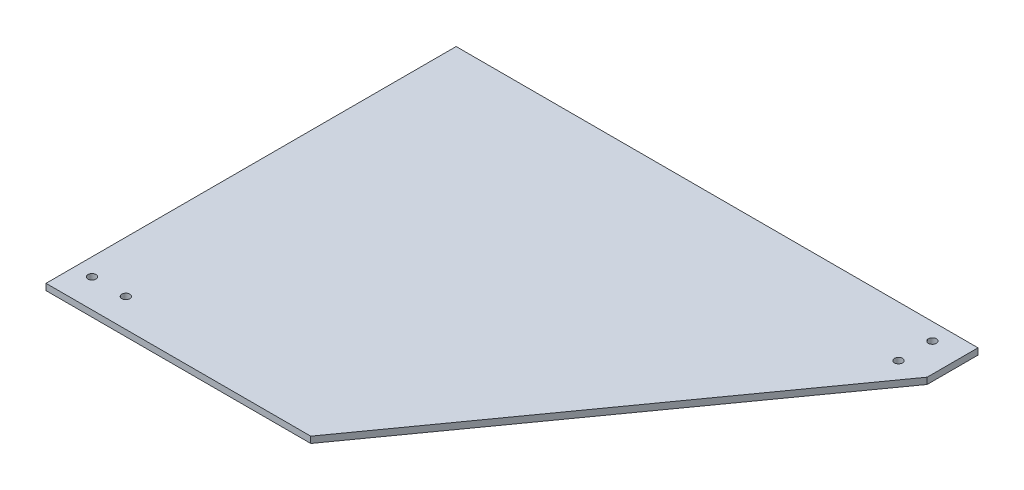
ISO-10303-21;
HEADER;
FILE_DESCRIPTION(('STEP AP214'),'2;1');
FILE_NAME('part.step','',(''),(''),'','','');
FILE_SCHEMA(('AUTOMOTIVE_DESIGN { 1 0 10303 214 1 1 1 1 }'));
ENDSEC;
DATA;
#1=APPLICATION_CONTEXT('core data for automotive mechanical design processes');
#2=APPLICATION_PROTOCOL_DEFINITION('international standard','automotive_design',2000,#1);
#3=PRODUCT_CONTEXT('',#1,'mechanical');
#4=PRODUCT('Part','Part','',(#3));
#5=PRODUCT_RELATED_PRODUCT_CATEGORY('part','',(#4));
#6=PRODUCT_DEFINITION_FORMATION('','',#4);
#7=PRODUCT_DEFINITION_CONTEXT('part definition',#1,'design');
#8=PRODUCT_DEFINITION('design','',#6,#7);
#9=PRODUCT_DEFINITION_SHAPE('','',#8);
#10=(LENGTH_UNIT() NAMED_UNIT(*) SI_UNIT(.MILLI.,.METRE.));
#11=(NAMED_UNIT(*) PLANE_ANGLE_UNIT() SI_UNIT($,.RADIAN.));
#12=(NAMED_UNIT(*) SI_UNIT($,.STERADIAN.) SOLID_ANGLE_UNIT());
#13=UNCERTAINTY_MEASURE_WITH_UNIT(LENGTH_MEASURE(1.E-05),#10,'distance_accuracy_value','');
#14=(GEOMETRIC_REPRESENTATION_CONTEXT(3) GLOBAL_UNCERTAINTY_ASSIGNED_CONTEXT((#13)) GLOBAL_UNIT_ASSIGNED_CONTEXT((#10,
#11,#12)) REPRESENTATION_CONTEXT('',''));
#15=CARTESIAN_POINT('',(0.,0.,0.));
#16=DIRECTION('',(0.,0.,1.));
#17=DIRECTION('',(1.,0.,0.));
#18=AXIS2_PLACEMENT_3D('',#15,#16,#17);
#19=CARTESIAN_POINT('',(0.,3.,0.));
#20=DIRECTION('',(0.,1.,0.));
#21=DIRECTION('',(0.,0.,1.));
#22=AXIS2_PLACEMENT_3D('',#19,#20,#21);
#23=PLANE('',#22);
#24=CARTESIAN_POINT('',(-115.,3.,180.152));
#25=DIRECTION('',(0.,1.,0.));
#26=DIRECTION('',(0.,0.,1.));
#27=AXIS2_PLACEMENT_3D('',#24,#25,#26);
#28=CIRCLE('',#27,1.89229999999999);
#29=CARTESIAN_POINT('',(-115.,3.,182.0443));
#30=VERTEX_POINT('',#29);
#31=EDGE_CURVE('E172',#30,#30,#28,.T.);
#32=ORIENTED_EDGE('',*,*,#31,.F.);
#33=EDGE_LOOP('',(#32));
#34=FACE_BOUND('',#33,.T.);
#35=CARTESIAN_POINT('',(-99.,3.,180.152));
#36=DIRECTION('',(0.,1.,0.));
#37=DIRECTION('',(0.,0.,1.));
#38=AXIS2_PLACEMENT_3D('',#35,#36,#37);
#39=CIRCLE('',#38,1.89230000000002);
#40=CARTESIAN_POINT('',(-99.,3.,182.0443));
#41=VERTEX_POINT('',#40);
#42=EDGE_CURVE('E112',#41,#41,#39,.T.);
#43=ORIENTED_EDGE('',*,*,#42,.F.);
#44=EDGE_LOOP('',(#43));
#45=FACE_BOUND('',#44,.T.);
#46=DIRECTION('',(0.,0.,1.));
#47=VECTOR('',#46,1.);
#48=CARTESIAN_POINT('',(-123.2,3.,0.));
#49=LINE('',#48,#47);
#50=CARTESIAN_POINT('',(-123.2,3.,0.));
#51=VERTEX_POINT('',#50);
#52=CARTESIAN_POINT('',(-123.2,3.,193.652));
#53=VERTEX_POINT('',#52);
#54=EDGE_CURVE('E117',#51,#53,#49,.T.);
#55=ORIENTED_EDGE('',*,*,#54,.T.);
#56=DIRECTION('',(1.,0.,0.));
#57=VECTOR('',#56,1.);
#58=CARTESIAN_POINT('',(-123.2,3.,193.652));
#59=LINE('',#58,#57);
#60=CARTESIAN_POINT('',(1.80000000000003,3.,193.652));
#61=VERTEX_POINT('',#60);
#62=EDGE_CURVE('E84',#53,#61,#59,.T.);
#63=ORIENTED_EDGE('',*,*,#62,.T.);
#64=DIRECTION('',(0.581936282512677,0.,-0.81323438386195));
#65=VECTOR('',#64,1.);
#66=CARTESIAN_POINT('',(1.80000000000003,3.,193.652));
#67=LINE('',#66,#65);
#68=CARTESIAN_POINT('',(123.2,3.,24.));
#69=VERTEX_POINT('',#68);
#70=EDGE_CURVE('E88',#61,#69,#67,.T.);
#71=ORIENTED_EDGE('',*,*,#70,.T.);
#72=DIRECTION('',(0.,0.,-1.));
#73=VECTOR('',#72,1.);
#74=CARTESIAN_POINT('',(123.2,3.,0.));
#75=LINE('',#74,#73);
#76=CARTESIAN_POINT('',(123.2,3.,0.));
#77=VERTEX_POINT('',#76);
#78=EDGE_CURVE('E92',#69,#77,#75,.T.);
#79=ORIENTED_EDGE('',*,*,#78,.T.);
#80=DIRECTION('',(-1.,0.,0.));
#81=VECTOR('',#80,1.);
#82=CARTESIAN_POINT('',(-123.2,3.,0.));
#83=LINE('',#82,#81);
#84=EDGE_CURVE('E50',#77,#51,#83,.T.);
#85=ORIENTED_EDGE('',*,*,#84,.T.);
#86=EDGE_LOOP('',(#55,#63,#71,#79,#85));
#87=FACE_BOUND('',#86,.T.);
#88=CARTESIAN_POINT('',(109.675,3.,8.00000000000001));
#89=DIRECTION('',(0.,1.,0.));
#90=DIRECTION('',(0.,0.,1.));
#91=AXIS2_PLACEMENT_3D('',#88,#89,#90);
#92=CIRCLE('',#91,1.89230000000002);
#93=CARTESIAN_POINT('',(109.675,3.,9.89230000000003));
#94=VERTEX_POINT('',#93);
#95=EDGE_CURVE('E178',#94,#94,#92,.T.);
#96=ORIENTED_EDGE('',*,*,#95,.F.);
#97=EDGE_LOOP('',(#96));
#98=FACE_BOUND('',#97,.T.);
#99=CARTESIAN_POINT('',(109.675,3.,24.));
#100=DIRECTION('',(0.,1.,0.));
#101=DIRECTION('',(0.,0.,1.));
#102=AXIS2_PLACEMENT_3D('',#99,#100,#101);
#103=CIRCLE('',#102,1.89229999999999);
#104=CARTESIAN_POINT('',(109.675,3.,25.8923));
#105=VERTEX_POINT('',#104);
#106=EDGE_CURVE('E163',#105,#105,#103,.T.);
#107=ORIENTED_EDGE('',*,*,#106,.F.);
#108=EDGE_LOOP('',(#107));
#109=FACE_BOUND('',#108,.T.);
#110=ADVANCED_FACE('F33',(#34,#45,#87,#98,#109),#23,.T.);
#111=CARTESIAN_POINT('',(0.,0.,0.));
#112=DIRECTION('',(0.,1.,0.));
#113=DIRECTION('',(0.,0.,1.));
#114=AXIS2_PLACEMENT_3D('',#111,#112,#113);
#115=PLANE('',#114);
#116=DIRECTION('',(0.,0.,1.));
#117=VECTOR('',#116,1.);
#118=CARTESIAN_POINT('',(-123.2,0.,0.));
#119=LINE('',#118,#117);
#120=CARTESIAN_POINT('',(-123.2,0.,0.));
#121=VERTEX_POINT('',#120);
#122=CARTESIAN_POINT('',(-123.2,0.,193.652));
#123=VERTEX_POINT('',#122);
#124=EDGE_CURVE('E108',#121,#123,#119,.T.);
#125=ORIENTED_EDGE('',*,*,#124,.F.);
#126=DIRECTION('',(-1.,0.,0.));
#127=VECTOR('',#126,1.);
#128=CARTESIAN_POINT('',(-123.2,0.,0.));
#129=LINE('',#128,#127);
#130=CARTESIAN_POINT('',(123.2,0.,0.));
#131=VERTEX_POINT('',#130);
#132=EDGE_CURVE('E76',#131,#121,#129,.T.);
#133=ORIENTED_EDGE('',*,*,#132,.F.);
#134=DIRECTION('',(0.,0.,-1.));
#135=VECTOR('',#134,1.);
#136=CARTESIAN_POINT('',(123.2,0.,0.));
#137=LINE('',#136,#135);
#138=CARTESIAN_POINT('',(123.2,0.,24.));
#139=VERTEX_POINT('',#138);
#140=EDGE_CURVE('E70',#139,#131,#137,.T.);
#141=ORIENTED_EDGE('',*,*,#140,.F.);
#142=DIRECTION('',(0.581936282512677,0.,-0.81323438386195));
#143=VECTOR('',#142,1.);
#144=CARTESIAN_POINT('',(1.80000000000003,0.,193.652));
#145=LINE('',#144,#143);
#146=CARTESIAN_POINT('',(1.80000000000003,0.,193.652));
#147=VERTEX_POINT('',#146);
#148=EDGE_CURVE('E99',#147,#139,#145,.T.);
#149=ORIENTED_EDGE('',*,*,#148,.F.);
#150=DIRECTION('',(1.,0.,0.));
#151=VECTOR('',#150,1.);
#152=CARTESIAN_POINT('',(-123.2,0.,193.652));
#153=LINE('',#152,#151);
#154=EDGE_CURVE('E111',#123,#147,#153,.T.);
#155=ORIENTED_EDGE('',*,*,#154,.F.);
#156=EDGE_LOOP('',(#125,#133,#141,#149,#155));
#157=FACE_BOUND('',#156,.T.);
#158=CARTESIAN_POINT('',(-99.,0.,180.152));
#159=DIRECTION('',(0.,1.,0.));
#160=DIRECTION('',(0.,0.,1.));
#161=AXIS2_PLACEMENT_3D('',#158,#159,#160);
#162=CIRCLE('',#161,1.89230000000002);
#163=CARTESIAN_POINT('',(-99.,0.,182.0443));
#164=VERTEX_POINT('',#163);
#165=EDGE_CURVE('E181',#164,#164,#162,.T.);
#166=ORIENTED_EDGE('',*,*,#165,.T.);
#167=EDGE_LOOP('',(#166));
#168=FACE_BOUND('',#167,.T.);
#169=CARTESIAN_POINT('',(109.675,0.,8.00000000000001));
#170=DIRECTION('',(0.,1.,0.));
#171=DIRECTION('',(0.,0.,1.));
#172=AXIS2_PLACEMENT_3D('',#169,#170,#171);
#173=CIRCLE('',#172,1.89230000000002);
#174=CARTESIAN_POINT('',(109.675,0.,9.89230000000003));
#175=VERTEX_POINT('',#174);
#176=EDGE_CURVE('E175',#175,#175,#173,.T.);
#177=ORIENTED_EDGE('',*,*,#176,.T.);
#178=EDGE_LOOP('',(#177));
#179=FACE_BOUND('',#178,.T.);
#180=CARTESIAN_POINT('',(-115.,0.,180.152));
#181=DIRECTION('',(0.,1.,0.));
#182=DIRECTION('',(0.,0.,1.));
#183=AXIS2_PLACEMENT_3D('',#180,#181,#182);
#184=CIRCLE('',#183,1.89229999999999);
#185=CARTESIAN_POINT('',(-115.,0.,182.0443));
#186=VERTEX_POINT('',#185);
#187=EDGE_CURVE('E169',#186,#186,#184,.T.);
#188=ORIENTED_EDGE('',*,*,#187,.T.);
#189=EDGE_LOOP('',(#188));
#190=FACE_BOUND('',#189,.T.);
#191=CARTESIAN_POINT('',(109.675,0.,24.));
#192=DIRECTION('',(0.,1.,0.));
#193=DIRECTION('',(0.,0.,1.));
#194=AXIS2_PLACEMENT_3D('',#191,#192,#193);
#195=CIRCLE('',#194,1.89229999999999);
#196=CARTESIAN_POINT('',(109.675,0.,25.8923));
#197=VERTEX_POINT('',#196);
#198=EDGE_CURVE('E166',#197,#197,#195,.T.);
#199=ORIENTED_EDGE('',*,*,#198,.T.);
#200=EDGE_LOOP('',(#199));
#201=FACE_BOUND('',#200,.T.);
#202=ADVANCED_FACE('F121',(#157,#168,#179,#190,#201),#115,.F.);
#203=CARTESIAN_POINT('',(-123.2,3.,0.));
#204=DIRECTION('',(1.,0.,0.));
#205=DIRECTION('',(0.,0.,-1.));
#206=AXIS2_PLACEMENT_3D('',#203,#204,#205);
#207=PLANE('',#206);
#208=ORIENTED_EDGE('',*,*,#124,.T.);
#209=DIRECTION('',(0.,-1.,0.));
#210=VECTOR('',#209,1.);
#211=CARTESIAN_POINT('',(-123.2,3.,193.652));
#212=LINE('',#211,#210);
#213=EDGE_CURVE('E11',#53,#123,#212,.T.);
#214=ORIENTED_EDGE('',*,*,#213,.F.);
#215=ORIENTED_EDGE('',*,*,#54,.F.);
#216=DIRECTION('',(0.,-1.,0.));
#217=VECTOR('',#216,1.);
#218=CARTESIAN_POINT('',(-123.2,3.,0.));
#219=LINE('',#218,#217);
#220=EDGE_CURVE('E104',#51,#121,#219,.T.);
#221=ORIENTED_EDGE('',*,*,#220,.T.);
#222=EDGE_LOOP('',(#208,#214,#215,#221));
#223=FACE_BOUND('',#222,.T.);
#224=ADVANCED_FACE('F35',(#223),#207,.F.);
#225=CARTESIAN_POINT('',(-123.2,3.,193.652));
#226=DIRECTION('',(0.,0.,-1.));
#227=DIRECTION('',(-1.,0.,0.));
#228=AXIS2_PLACEMENT_3D('',#225,#226,#227);
#229=PLANE('',#228);
#230=ORIENTED_EDGE('',*,*,#154,.T.);
#231=DIRECTION('',(0.,-1.,0.));
#232=VECTOR('',#231,1.);
#233=CARTESIAN_POINT('',(1.80000000000003,3.,193.652));
#234=LINE('',#233,#232);
#235=EDGE_CURVE('E42',#61,#147,#234,.T.);
#236=ORIENTED_EDGE('',*,*,#235,.F.);
#237=ORIENTED_EDGE('',*,*,#62,.F.);
#238=ORIENTED_EDGE('',*,*,#213,.T.);
#239=EDGE_LOOP('',(#230,#236,#237,#238));
#240=FACE_BOUND('',#239,.T.);
#241=ADVANCED_FACE('F230',(#240),#229,.F.);
#242=CARTESIAN_POINT('',(1.80000000000003,3.,193.652));
#243=DIRECTION('',(-0.81323438386195,0.,-0.581936282512677));
#244=DIRECTION('',(-0.581936282512677,0.,0.81323438386195));
#245=AXIS2_PLACEMENT_3D('',#242,#243,#244);
#246=PLANE('',#245);
#247=ORIENTED_EDGE('',*,*,#148,.T.);
#248=DIRECTION('',(0.,-1.,0.));
#249=VECTOR('',#248,1.);
#250=CARTESIAN_POINT('',(123.2,3.,24.));
#251=LINE('',#250,#249);
#252=EDGE_CURVE('E96',#69,#139,#251,.T.);
#253=ORIENTED_EDGE('',*,*,#252,.F.);
#254=ORIENTED_EDGE('',*,*,#70,.F.);
#255=ORIENTED_EDGE('',*,*,#235,.T.);
#256=EDGE_LOOP('',(#247,#253,#254,#255));
#257=FACE_BOUND('',#256,.T.);
#258=ADVANCED_FACE('F97',(#257),#246,.F.);
#259=CARTESIAN_POINT('',(123.2,3.,0.));
#260=DIRECTION('',(-1.,0.,0.));
#261=DIRECTION('',(0.,0.,1.));
#262=AXIS2_PLACEMENT_3D('',#259,#260,#261);
#263=PLANE('',#262);
#264=ORIENTED_EDGE('',*,*,#140,.T.);
#265=DIRECTION('',(0.,-1.,0.));
#266=VECTOR('',#265,1.);
#267=CARTESIAN_POINT('',(123.2,3.,0.));
#268=LINE('',#267,#266);
#269=EDGE_CURVE('E100',#77,#131,#268,.T.);
#270=ORIENTED_EDGE('',*,*,#269,.F.);
#271=ORIENTED_EDGE('',*,*,#78,.F.);
#272=ORIENTED_EDGE('',*,*,#252,.T.);
#273=EDGE_LOOP('',(#264,#270,#271,#272));
#274=FACE_BOUND('',#273,.T.);
#275=ADVANCED_FACE('F102',(#274),#263,.F.);
#276=CARTESIAN_POINT('',(-123.2,3.,0.));
#277=DIRECTION('',(0.,0.,1.));
#278=DIRECTION('',(1.,0.,0.));
#279=AXIS2_PLACEMENT_3D('',#276,#277,#278);
#280=PLANE('',#279);
#281=ORIENTED_EDGE('',*,*,#132,.T.);
#282=ORIENTED_EDGE('',*,*,#220,.F.);
#283=ORIENTED_EDGE('',*,*,#84,.F.);
#284=ORIENTED_EDGE('',*,*,#269,.T.);
#285=EDGE_LOOP('',(#281,#282,#283,#284));
#286=FACE_BOUND('',#285,.T.);
#287=ADVANCED_FACE('F126',(#286),#280,.F.);
#288=CARTESIAN_POINT('',(-99.,3.,180.152));
#289=DIRECTION('',(0.,-1.,0.));
#290=DIRECTION('',(0.,0.,-1.));
#291=AXIS2_PLACEMENT_3D('',#288,#289,#290);
#292=CYLINDRICAL_SURFACE('',#291,1.89230000000002);
#293=ORIENTED_EDGE('',*,*,#42,.T.);
#294=EDGE_LOOP('',(#293));
#295=FACE_BOUND('',#294,.T.);
#296=ORIENTED_EDGE('',*,*,#165,.F.);
#297=EDGE_LOOP('',(#296));
#298=FACE_BOUND('',#297,.T.);
#299=ADVANCED_FACE('F128',(#295,#298),#292,.F.);
#300=CARTESIAN_POINT('',(109.675,3.,8.00000000000001));
#301=DIRECTION('',(0.,-1.,0.));
#302=DIRECTION('',(0.,0.,-1.));
#303=AXIS2_PLACEMENT_3D('',#300,#301,#302);
#304=CYLINDRICAL_SURFACE('',#303,1.89230000000002);
#305=ORIENTED_EDGE('',*,*,#95,.T.);
#306=EDGE_LOOP('',(#305));
#307=FACE_BOUND('',#306,.T.);
#308=ORIENTED_EDGE('',*,*,#176,.F.);
#309=EDGE_LOOP('',(#308));
#310=FACE_BOUND('',#309,.T.);
#311=ADVANCED_FACE('F134',(#307,#310),#304,.F.);
#312=CARTESIAN_POINT('',(-115.,3.,180.152));
#313=DIRECTION('',(0.,-1.,0.));
#314=DIRECTION('',(0.,0.,-1.));
#315=AXIS2_PLACEMENT_3D('',#312,#313,#314);
#316=CYLINDRICAL_SURFACE('',#315,1.89229999999999);
#317=ORIENTED_EDGE('',*,*,#31,.T.);
#318=EDGE_LOOP('',(#317));
#319=FACE_BOUND('',#318,.T.);
#320=ORIENTED_EDGE('',*,*,#187,.F.);
#321=EDGE_LOOP('',(#320));
#322=FACE_BOUND('',#321,.T.);
#323=ADVANCED_FACE('F150',(#319,#322),#316,.F.);
#324=CARTESIAN_POINT('',(109.675,3.,24.));
#325=DIRECTION('',(0.,-1.,0.));
#326=DIRECTION('',(0.,0.,-1.));
#327=AXIS2_PLACEMENT_3D('',#324,#325,#326);
#328=CYLINDRICAL_SURFACE('',#327,1.89229999999999);
#329=ORIENTED_EDGE('',*,*,#106,.T.);
#330=EDGE_LOOP('',(#329));
#331=FACE_BOUND('',#330,.T.);
#332=ORIENTED_EDGE('',*,*,#198,.F.);
#333=EDGE_LOOP('',(#332));
#334=FACE_BOUND('',#333,.T.);
#335=ADVANCED_FACE('F154',(#331,#334),#328,.F.);
#336=CLOSED_SHELL('',(#110,#202,#224,#241,#258,#275,#287,#299,#311,#323,#335));
#337=MANIFOLD_SOLID_BREP('B2',#336);
#338=ADVANCED_BREP_SHAPE_REPRESENTATION('',(#18,#337),#14);
#339=SHAPE_DEFINITION_REPRESENTATION(#9,#338);
ENDSEC;
END-ISO-10303-21;
